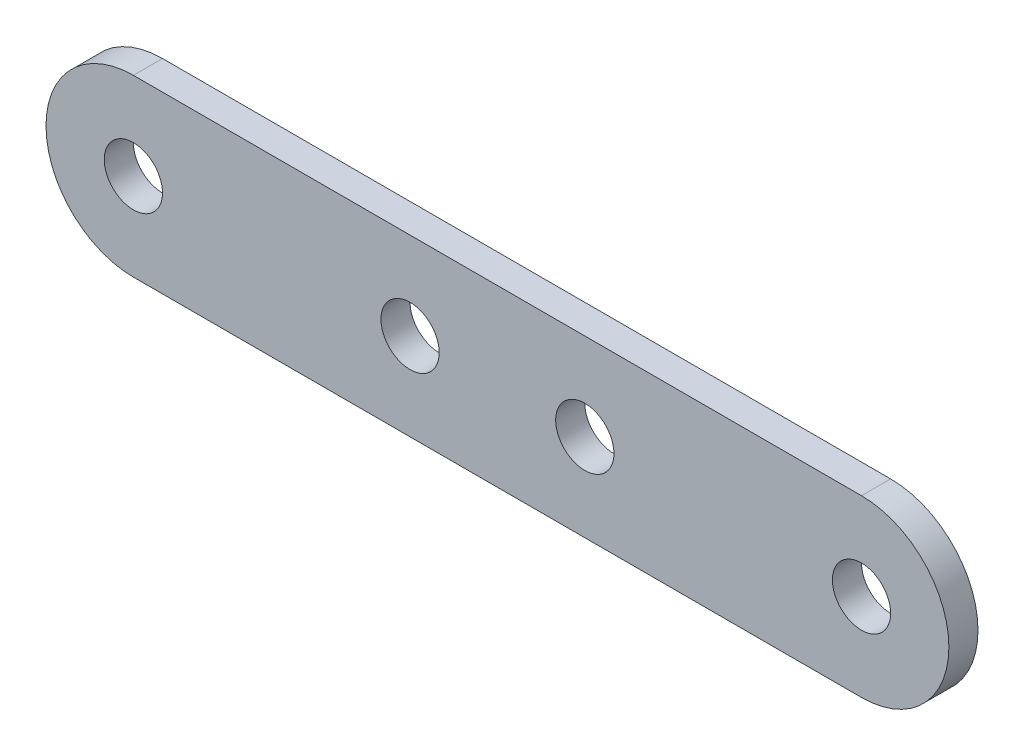
ISO-10303-21;
HEADER;
FILE_DESCRIPTION(('STEP AP214'),'2;1');
FILE_NAME('part.step','',(''),(''),'','','');
FILE_SCHEMA(('AUTOMOTIVE_DESIGN { 1 0 10303 214 1 1 1 1 }'));
ENDSEC;
DATA;
#1=APPLICATION_CONTEXT('core data for automotive mechanical design processes');
#2=APPLICATION_PROTOCOL_DEFINITION('international standard','automotive_design',2000,#1);
#3=PRODUCT_CONTEXT('',#1,'mechanical');
#4=PRODUCT('Part','Part','',(#3));
#5=PRODUCT_RELATED_PRODUCT_CATEGORY('part','',(#4));
#6=PRODUCT_DEFINITION_FORMATION('','',#4);
#7=PRODUCT_DEFINITION_CONTEXT('part definition',#1,'design');
#8=PRODUCT_DEFINITION('design','',#6,#7);
#9=PRODUCT_DEFINITION_SHAPE('','',#8);
#10=(LENGTH_UNIT() NAMED_UNIT(*) SI_UNIT(.MILLI.,.METRE.));
#11=(NAMED_UNIT(*) PLANE_ANGLE_UNIT() SI_UNIT($,.RADIAN.));
#12=(NAMED_UNIT(*) SI_UNIT($,.STERADIAN.) SOLID_ANGLE_UNIT());
#13=UNCERTAINTY_MEASURE_WITH_UNIT(LENGTH_MEASURE(1.E-05),#10,'distance_accuracy_value','');
#14=(GEOMETRIC_REPRESENTATION_CONTEXT(3) GLOBAL_UNCERTAINTY_ASSIGNED_CONTEXT((#13)) GLOBAL_UNIT_ASSIGNED_CONTEXT((#10,
#11,#12)) REPRESENTATION_CONTEXT('',''));
#15=CARTESIAN_POINT('',(0.,0.,0.));
#16=DIRECTION('',(0.,0.,1.));
#17=DIRECTION('',(1.,0.,0.));
#18=AXIS2_PLACEMENT_3D('',#15,#16,#17);
#19=CARTESIAN_POINT('',(0.,-12.,-2.));
#20=DIRECTION('',(0.,-1.,0.));
#21=DIRECTION('',(0.,0.,-1.));
#22=AXIS2_PLACEMENT_3D('',#19,#20,#21);
#23=PLANE('',#22);
#24=DIRECTION('',(1.,0.,0.));
#25=VECTOR('',#24,1.);
#26=CARTESIAN_POINT('',(0.,-12.,0.));
#27=LINE('',#26,#25);
#28=CARTESIAN_POINT('',(6.,-12.,0.));
#29=VERTEX_POINT('',#28);
#30=CARTESIAN_POINT('',(56.,-12.,0.));
#31=VERTEX_POINT('',#30);
#32=EDGE_CURVE('E111',#29,#31,#27,.T.);
#33=ORIENTED_EDGE('',*,*,#32,.F.);
#34=DIRECTION('',(0.,0.,1.));
#35=VECTOR('',#34,1.);
#36=CARTESIAN_POINT('',(6.,-12.,-2.));
#37=LINE('',#36,#35);
#38=CARTESIAN_POINT('',(6.,-12.,-2.));
#39=VERTEX_POINT('',#38);
#40=EDGE_CURVE('E11',#39,#29,#37,.T.);
#41=ORIENTED_EDGE('',*,*,#40,.F.);
#42=DIRECTION('',(1.,0.,0.));
#43=VECTOR('',#42,1.);
#44=CARTESIAN_POINT('',(0.,-12.,-2.));
#45=LINE('',#44,#43);
#46=CARTESIAN_POINT('',(56.,-12.,-2.));
#47=VERTEX_POINT('',#46);
#48=EDGE_CURVE('E92',#39,#47,#45,.T.);
#49=ORIENTED_EDGE('',*,*,#48,.T.);
#50=DIRECTION('',(0.,0.,1.));
#51=VECTOR('',#50,1.);
#52=CARTESIAN_POINT('',(56.,-12.,-2.));
#53=LINE('',#52,#51);
#54=EDGE_CURVE('E37',#47,#31,#53,.T.);
#55=ORIENTED_EDGE('',*,*,#54,.T.);
#56=EDGE_LOOP('',(#33,#41,#49,#55));
#57=FACE_BOUND('',#56,.T.);
#58=ADVANCED_FACE('F33',(#57),#23,.T.);
#59=CARTESIAN_POINT('',(6.,-6.,-2.));
#60=DIRECTION('',(0.,0.,1.));
#61=DIRECTION('',(1.,0.,0.));
#62=AXIS2_PLACEMENT_3D('',#59,#60,#61);
#63=CYLINDRICAL_SURFACE('',#62,6.);
#64=CARTESIAN_POINT('',(6.,-6.,0.));
#65=DIRECTION('',(0.,0.,1.));
#66=DIRECTION('',(1.,0.,0.));
#67=AXIS2_PLACEMENT_3D('',#64,#65,#66);
#68=CIRCLE('',#67,6.);
#69=CARTESIAN_POINT('',(6.,0.,0.));
#70=VERTEX_POINT('',#69);
#71=EDGE_CURVE('E117',#70,#29,#68,.T.);
#72=ORIENTED_EDGE('',*,*,#71,.F.);
#73=DIRECTION('',(0.,0.,1.));
#74=VECTOR('',#73,1.);
#75=CARTESIAN_POINT('',(6.,0.,-2.));
#76=LINE('',#75,#74);
#77=CARTESIAN_POINT('',(6.,0.,-2.));
#78=VERTEX_POINT('',#77);
#79=EDGE_CURVE('E43',#78,#70,#76,.T.);
#80=ORIENTED_EDGE('',*,*,#79,.F.);
#81=CARTESIAN_POINT('',(6.,-6.,-2.));
#82=DIRECTION('',(0.,0.,1.));
#83=DIRECTION('',(1.,0.,0.));
#84=AXIS2_PLACEMENT_3D('',#81,#82,#83);
#85=CIRCLE('',#84,6.);
#86=EDGE_CURVE('E85',#78,#39,#85,.T.);
#87=ORIENTED_EDGE('',*,*,#86,.T.);
#88=ORIENTED_EDGE('',*,*,#40,.T.);
#89=EDGE_LOOP('',(#72,#80,#87,#88));
#90=FACE_BOUND('',#89,.T.);
#91=ADVANCED_FACE('F147',(#90),#63,.T.);
#92=CARTESIAN_POINT('',(0.,0.,-2.));
#93=DIRECTION('',(0.,-1.,0.));
#94=DIRECTION('',(0.,0.,-1.));
#95=AXIS2_PLACEMENT_3D('',#92,#93,#94);
#96=PLANE('',#95);
#97=DIRECTION('',(1.,0.,0.));
#98=VECTOR('',#97,1.);
#99=CARTESIAN_POINT('',(0.,0.,0.));
#100=LINE('',#99,#98);
#101=CARTESIAN_POINT('',(56.,0.,0.));
#102=VERTEX_POINT('',#101);
#103=EDGE_CURVE('E89',#70,#102,#100,.T.);
#104=ORIENTED_EDGE('',*,*,#103,.T.);
#105=DIRECTION('',(0.,0.,1.));
#106=VECTOR('',#105,1.);
#107=CARTESIAN_POINT('',(56.,0.,-2.));
#108=LINE('',#107,#106);
#109=CARTESIAN_POINT('',(56.,0.,-2.));
#110=VERTEX_POINT('',#109);
#111=EDGE_CURVE('E87',#110,#102,#108,.T.);
#112=ORIENTED_EDGE('',*,*,#111,.F.);
#113=DIRECTION('',(1.,0.,0.));
#114=VECTOR('',#113,1.);
#115=CARTESIAN_POINT('',(0.,0.,-2.));
#116=LINE('',#115,#114);
#117=EDGE_CURVE('E81',#78,#110,#116,.T.);
#118=ORIENTED_EDGE('',*,*,#117,.F.);
#119=ORIENTED_EDGE('',*,*,#79,.T.);
#120=EDGE_LOOP('',(#104,#112,#118,#119));
#121=FACE_BOUND('',#120,.T.);
#122=ADVANCED_FACE('F88',(#121),#96,.F.);
#123=CARTESIAN_POINT('',(56.,-6.,-2.));
#124=DIRECTION('',(0.,0.,1.));
#125=DIRECTION('',(1.,0.,0.));
#126=AXIS2_PLACEMENT_3D('',#123,#124,#125);
#127=CYLINDRICAL_SURFACE('',#126,2.);
#128=CARTESIAN_POINT('',(56.,-6.,-2.));
#129=DIRECTION('',(0.,0.,1.));
#130=DIRECTION('',(1.,0.,0.));
#131=AXIS2_PLACEMENT_3D('',#128,#129,#130);
#132=CIRCLE('',#131,2.);
#133=CARTESIAN_POINT('',(58.,-6.,-2.));
#134=VERTEX_POINT('',#133);
#135=EDGE_CURVE('E94',#134,#134,#132,.T.);
#136=ORIENTED_EDGE('',*,*,#135,.F.);
#137=EDGE_LOOP('',(#136));
#138=FACE_BOUND('',#137,.T.);
#139=CARTESIAN_POINT('',(56.,-6.,0.));
#140=DIRECTION('',(0.,0.,1.));
#141=DIRECTION('',(1.,0.,0.));
#142=AXIS2_PLACEMENT_3D('',#139,#140,#141);
#143=CIRCLE('',#142,2.);
#144=CARTESIAN_POINT('',(58.,-6.,0.));
#145=VERTEX_POINT('',#144);
#146=EDGE_CURVE('E108',#145,#145,#143,.T.);
#147=ORIENTED_EDGE('',*,*,#146,.T.);
#148=EDGE_LOOP('',(#147));
#149=FACE_BOUND('',#148,.T.);
#150=ADVANCED_FACE('F136',(#138,#149),#127,.F.);
#151=CARTESIAN_POINT('',(37.,-6.,-2.));
#152=DIRECTION('',(0.,0.,1.));
#153=DIRECTION('',(1.,0.,0.));
#154=AXIS2_PLACEMENT_3D('',#151,#152,#153);
#155=CYLINDRICAL_SURFACE('',#154,2.);
#156=CARTESIAN_POINT('',(37.,-6.,-2.));
#157=DIRECTION('',(0.,0.,1.));
#158=DIRECTION('',(1.,0.,0.));
#159=AXIS2_PLACEMENT_3D('',#156,#157,#158);
#160=CIRCLE('',#159,2.);
#161=CARTESIAN_POINT('',(39.,-6.,-2.));
#162=VERTEX_POINT('',#161);
#163=EDGE_CURVE('E128',#162,#162,#160,.T.);
#164=ORIENTED_EDGE('',*,*,#163,.F.);
#165=EDGE_LOOP('',(#164));
#166=FACE_BOUND('',#165,.T.);
#167=CARTESIAN_POINT('',(37.,-6.,0.));
#168=DIRECTION('',(0.,0.,1.));
#169=DIRECTION('',(1.,0.,0.));
#170=AXIS2_PLACEMENT_3D('',#167,#168,#169);
#171=CIRCLE('',#170,2.);
#172=CARTESIAN_POINT('',(39.,-6.,0.));
#173=VERTEX_POINT('',#172);
#174=EDGE_CURVE('E105',#173,#173,#171,.T.);
#175=ORIENTED_EDGE('',*,*,#174,.T.);
#176=EDGE_LOOP('',(#175));
#177=FACE_BOUND('',#176,.T.);
#178=ADVANCED_FACE('F139',(#166,#177),#155,.F.);
#179=CARTESIAN_POINT('',(25.,-6.,-2.));
#180=DIRECTION('',(0.,0.,1.));
#181=DIRECTION('',(1.,0.,0.));
#182=AXIS2_PLACEMENT_3D('',#179,#180,#181);
#183=CYLINDRICAL_SURFACE('',#182,2.);
#184=CARTESIAN_POINT('',(25.,-6.,-2.));
#185=DIRECTION('',(0.,0.,1.));
#186=DIRECTION('',(1.,0.,0.));
#187=AXIS2_PLACEMENT_3D('',#184,#185,#186);
#188=CIRCLE('',#187,2.);
#189=CARTESIAN_POINT('',(27.,-6.,-2.));
#190=VERTEX_POINT('',#189);
#191=EDGE_CURVE('E123',#190,#190,#188,.T.);
#192=ORIENTED_EDGE('',*,*,#191,.F.);
#193=EDGE_LOOP('',(#192));
#194=FACE_BOUND('',#193,.T.);
#195=CARTESIAN_POINT('',(25.,-6.,0.));
#196=DIRECTION('',(0.,0.,1.));
#197=DIRECTION('',(1.,0.,0.));
#198=AXIS2_PLACEMENT_3D('',#195,#196,#197);
#199=CIRCLE('',#198,2.);
#200=CARTESIAN_POINT('',(27.,-6.,0.));
#201=VERTEX_POINT('',#200);
#202=EDGE_CURVE('E102',#201,#201,#199,.T.);
#203=ORIENTED_EDGE('',*,*,#202,.T.);
#204=EDGE_LOOP('',(#203));
#205=FACE_BOUND('',#204,.T.);
#206=ADVANCED_FACE('F161',(#194,#205),#183,.F.);
#207=CARTESIAN_POINT('',(6.,-6.,-2.));
#208=DIRECTION('',(0.,0.,1.));
#209=DIRECTION('',(1.,0.,0.));
#210=AXIS2_PLACEMENT_3D('',#207,#208,#209);
#211=CYLINDRICAL_SURFACE('',#210,2.);
#212=CARTESIAN_POINT('',(6.,-6.,-2.));
#213=DIRECTION('',(0.,0.,1.));
#214=DIRECTION('',(1.,0.,0.));
#215=AXIS2_PLACEMENT_3D('',#212,#213,#214);
#216=CIRCLE('',#215,2.);
#217=CARTESIAN_POINT('',(8.,-6.,-2.));
#218=VERTEX_POINT('',#217);
#219=EDGE_CURVE('E119',#218,#218,#216,.T.);
#220=ORIENTED_EDGE('',*,*,#219,.F.);
#221=EDGE_LOOP('',(#220));
#222=FACE_BOUND('',#221,.T.);
#223=CARTESIAN_POINT('',(6.,-6.,0.));
#224=DIRECTION('',(0.,0.,1.));
#225=DIRECTION('',(1.,0.,0.));
#226=AXIS2_PLACEMENT_3D('',#223,#224,#225);
#227=CIRCLE('',#226,2.);
#228=CARTESIAN_POINT('',(8.,-6.,0.));
#229=VERTEX_POINT('',#228);
#230=EDGE_CURVE('E99',#229,#229,#227,.T.);
#231=ORIENTED_EDGE('',*,*,#230,.T.);
#232=EDGE_LOOP('',(#231));
#233=FACE_BOUND('',#232,.T.);
#234=ADVANCED_FACE('F35',(#222,#233),#211,.F.);
#235=CARTESIAN_POINT('',(56.,-6.,-2.));
#236=DIRECTION('',(0.,0.,1.));
#237=DIRECTION('',(1.,0.,0.));
#238=AXIS2_PLACEMENT_3D('',#235,#236,#237);
#239=CYLINDRICAL_SURFACE('',#238,6.);
#240=CARTESIAN_POINT('',(56.,-6.,0.));
#241=DIRECTION('',(0.,0.,1.));
#242=DIRECTION('',(1.,0.,0.));
#243=AXIS2_PLACEMENT_3D('',#240,#241,#242);
#244=CIRCLE('',#243,6.);
#245=EDGE_CURVE('E114',#31,#102,#244,.T.);
#246=ORIENTED_EDGE('',*,*,#245,.F.);
#247=ORIENTED_EDGE('',*,*,#54,.F.);
#248=CARTESIAN_POINT('',(56.,-6.,-2.));
#249=DIRECTION('',(0.,0.,1.));
#250=DIRECTION('',(1.,0.,0.));
#251=AXIS2_PLACEMENT_3D('',#248,#249,#250);
#252=CIRCLE('',#251,6.);
#253=EDGE_CURVE('E84',#47,#110,#252,.T.);
#254=ORIENTED_EDGE('',*,*,#253,.T.);
#255=ORIENTED_EDGE('',*,*,#111,.T.);
#256=EDGE_LOOP('',(#246,#247,#254,#255));
#257=FACE_BOUND('',#256,.T.);
#258=ADVANCED_FACE('F91',(#257),#239,.T.);
#259=CARTESIAN_POINT('',(0.,0.,-2.));
#260=DIRECTION('',(0.,0.,1.));
#261=DIRECTION('',(1.,0.,0.));
#262=AXIS2_PLACEMENT_3D('',#259,#260,#261);
#263=PLANE('',#262);
#264=ORIENTED_EDGE('',*,*,#219,.T.);
#265=EDGE_LOOP('',(#264));
#266=FACE_BOUND('',#265,.T.);
#267=ORIENTED_EDGE('',*,*,#191,.T.);
#268=EDGE_LOOP('',(#267));
#269=FACE_BOUND('',#268,.T.);
#270=ORIENTED_EDGE('',*,*,#163,.T.);
#271=EDGE_LOOP('',(#270));
#272=FACE_BOUND('',#271,.T.);
#273=ORIENTED_EDGE('',*,*,#135,.T.);
#274=EDGE_LOOP('',(#273));
#275=FACE_BOUND('',#274,.T.);
#276=ORIENTED_EDGE('',*,*,#48,.F.);
#277=ORIENTED_EDGE('',*,*,#86,.F.);
#278=ORIENTED_EDGE('',*,*,#117,.T.);
#279=ORIENTED_EDGE('',*,*,#253,.F.);
#280=EDGE_LOOP('',(#276,#277,#278,#279));
#281=FACE_BOUND('',#280,.T.);
#282=ADVANCED_FACE('F83',(#266,#269,#272,#275,#281),#263,.F.);
#283=CARTESIAN_POINT('',(0.,0.,0.));
#284=DIRECTION('',(0.,0.,1.));
#285=DIRECTION('',(1.,0.,0.));
#286=AXIS2_PLACEMENT_3D('',#283,#284,#285);
#287=PLANE('',#286);
#288=ORIENTED_EDGE('',*,*,#230,.F.);
#289=EDGE_LOOP('',(#288));
#290=FACE_BOUND('',#289,.T.);
#291=ORIENTED_EDGE('',*,*,#202,.F.);
#292=EDGE_LOOP('',(#291));
#293=FACE_BOUND('',#292,.T.);
#294=ORIENTED_EDGE('',*,*,#174,.F.);
#295=EDGE_LOOP('',(#294));
#296=FACE_BOUND('',#295,.T.);
#297=ORIENTED_EDGE('',*,*,#146,.F.);
#298=EDGE_LOOP('',(#297));
#299=FACE_BOUND('',#298,.T.);
#300=ORIENTED_EDGE('',*,*,#32,.T.);
#301=ORIENTED_EDGE('',*,*,#245,.T.);
#302=ORIENTED_EDGE('',*,*,#103,.F.);
#303=ORIENTED_EDGE('',*,*,#71,.T.);
#304=EDGE_LOOP('',(#300,#301,#302,#303));
#305=FACE_BOUND('',#304,.T.);
#306=ADVANCED_FACE('F143',(#290,#293,#296,#299,#305),#287,.T.);
#307=CLOSED_SHELL('',(#58,#91,#122,#150,#178,#206,#234,#258,#282,#306));
#308=MANIFOLD_SOLID_BREP('B2',#307);
#309=ADVANCED_BREP_SHAPE_REPRESENTATION('',(#18,#308),#14);
#310=SHAPE_DEFINITION_REPRESENTATION(#9,#309);
ENDSEC;
END-ISO-10303-21;
